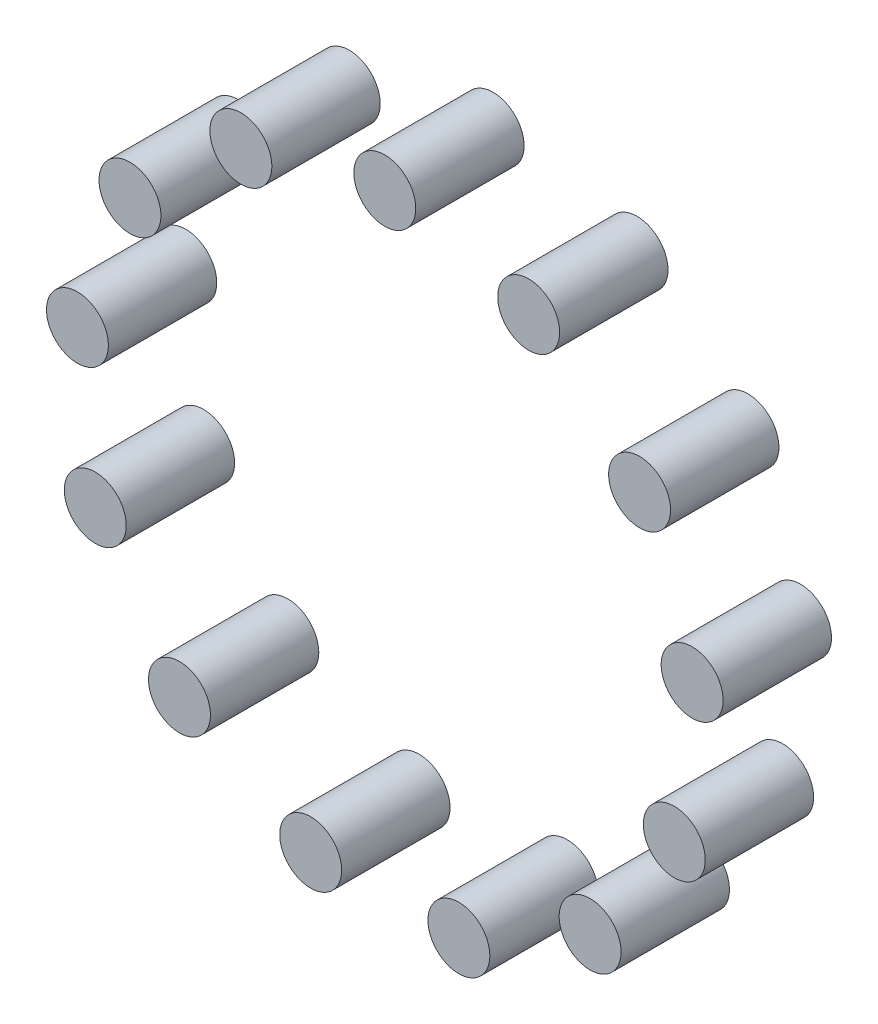
ISO-10303-21;
HEADER;
FILE_DESCRIPTION(('STEP AP214'),'2;1');
FILE_NAME('part.step','',(''),(''),'','','');
FILE_SCHEMA(('AUTOMOTIVE_DESIGN { 1 0 10303 214 1 1 1 1 }'));
ENDSEC;
DATA;
#1=APPLICATION_CONTEXT('core data for automotive mechanical design processes');
#2=APPLICATION_PROTOCOL_DEFINITION('international standard','automotive_design',2000,#1);
#3=PRODUCT_CONTEXT('',#1,'mechanical');
#4=PRODUCT('Part','Part','',(#3));
#5=PRODUCT_RELATED_PRODUCT_CATEGORY('part','',(#4));
#6=PRODUCT_DEFINITION_FORMATION('','',#4);
#7=PRODUCT_DEFINITION_CONTEXT('part definition',#1,'design');
#8=PRODUCT_DEFINITION('design','',#6,#7);
#9=PRODUCT_DEFINITION_SHAPE('','',#8);
#10=(LENGTH_UNIT() NAMED_UNIT(*) SI_UNIT(.MILLI.,.METRE.));
#11=(NAMED_UNIT(*) PLANE_ANGLE_UNIT() SI_UNIT($,.RADIAN.));
#12=(NAMED_UNIT(*) SI_UNIT($,.STERADIAN.) SOLID_ANGLE_UNIT());
#13=UNCERTAINTY_MEASURE_WITH_UNIT(LENGTH_MEASURE(1.E-05),#10,'distance_accuracy_value','');
#14=(GEOMETRIC_REPRESENTATION_CONTEXT(3) GLOBAL_UNCERTAINTY_ASSIGNED_CONTEXT((#13)) GLOBAL_UNIT_ASSIGNED_CONTEXT((#10,
#11,#12)) REPRESENTATION_CONTEXT('',''));
#15=CARTESIAN_POINT('',(0.,0.,0.));
#16=DIRECTION('',(0.,0.,1.));
#17=DIRECTION('',(1.,0.,0.));
#18=AXIS2_PLACEMENT_3D('',#15,#16,#17);
#19=CARTESIAN_POINT('',(-18.5889268817507,35.4182410261284,14.));
#20=DIRECTION('',(0.,0.,-1.));
#21=DIRECTION('',(-1.,0.,0.));
#22=AXIS2_PLACEMENT_3D('',#19,#20,#21);
#23=CYLINDRICAL_SURFACE('',#22,3.99999999999999);
#24=CARTESIAN_POINT('',(-18.5889268817507,35.4182410261284,14.));
#25=DIRECTION('',(0.,0.,1.));
#26=DIRECTION('',(1.,0.,0.));
#27=AXIS2_PLACEMENT_3D('',#24,#25,#26);
#28=CIRCLE('',#27,3.99999999999999);
#29=CARTESIAN_POINT('',(-14.5889268817507,35.4182410261284,14.));
#30=VERTEX_POINT('',#29);
#31=EDGE_CURVE('E11',#30,#30,#28,.T.);
#32=ORIENTED_EDGE('',*,*,#31,.F.);
#33=EDGE_LOOP('',(#32));
#34=FACE_BOUND('',#33,.T.);
#35=CARTESIAN_POINT('',(-18.5889268817507,35.4182410261284,0.));
#36=DIRECTION('',(0.,0.,1.));
#37=DIRECTION('',(1.,0.,0.));
#38=AXIS2_PLACEMENT_3D('',#35,#36,#37);
#39=CIRCLE('',#38,3.99999999999999);
#40=CARTESIAN_POINT('',(-14.5889268817507,35.4182410261284,0.));
#41=VERTEX_POINT('',#40);
#42=EDGE_CURVE('E55',#41,#41,#39,.T.);
#43=ORIENTED_EDGE('',*,*,#42,.T.);
#44=EDGE_LOOP('',(#43));
#45=FACE_BOUND('',#44,.T.);
#46=ADVANCED_FACE('F52',(#34,#45),#23,.T.);
#47=CARTESIAN_POINT('',(-18.5889268817507,35.4182410261284,14.));
#48=DIRECTION('',(0.,0.,1.));
#49=DIRECTION('',(1.,0.,0.));
#50=AXIS2_PLACEMENT_3D('',#47,#48,#49);
#51=PLANE('',#50);
#52=ORIENTED_EDGE('',*,*,#31,.T.);
#53=EDGE_LOOP('',(#52));
#54=FACE_BOUND('',#53,.T.);
#55=ADVANCED_FACE('F67',(#54),#51,.T.);
#56=CARTESIAN_POINT('',(-18.5889268817507,35.4182410261284,0.));
#57=DIRECTION('',(0.,0.,1.));
#58=DIRECTION('',(1.,0.,0.));
#59=AXIS2_PLACEMENT_3D('',#56,#57,#58);
#60=PLANE('',#59);
#61=ORIENTED_EDGE('',*,*,#42,.F.);
#62=EDGE_LOOP('',(#61));
#63=FACE_BOUND('',#62,.T.);
#64=ADVANCED_FACE('F65',(#63),#60,.F.);
#65=CLOSED_SHELL('',(#46,#55,#64));
#66=MANIFOLD_SOLID_BREP('B2',#65);
#67=CARTESIAN_POINT('',(-32.9193546357463,22.7225898692462,14.));
#68=DIRECTION('',(0.,0.,-1.));
#69=DIRECTION('',(-1.,0.,0.));
#70=AXIS2_PLACEMENT_3D('',#67,#68,#69);
#71=CYLINDRICAL_SURFACE('',#70,4.00000000000001);
#72=CARTESIAN_POINT('',(-32.9193546357463,22.7225898692462,14.));
#73=DIRECTION('',(0.,0.,1.));
#74=DIRECTION('',(1.,0.,0.));
#75=AXIS2_PLACEMENT_3D('',#72,#73,#74);
#76=CIRCLE('',#75,4.00000000000001);
#77=CARTESIAN_POINT('',(-28.9193546357463,22.7225898692462,14.));
#78=VERTEX_POINT('',#77);
#79=EDGE_CURVE('E51',#78,#78,#76,.T.);
#80=ORIENTED_EDGE('',*,*,#79,.F.);
#81=EDGE_LOOP('',(#80));
#82=FACE_BOUND('',#81,.T.);
#83=CARTESIAN_POINT('',(-32.9193546357463,22.7225898692462,0.));
#84=DIRECTION('',(0.,0.,1.));
#85=DIRECTION('',(1.,0.,0.));
#86=AXIS2_PLACEMENT_3D('',#83,#84,#85);
#87=CIRCLE('',#86,4.00000000000001);
#88=CARTESIAN_POINT('',(-28.9193546357463,22.7225898692462,0.));
#89=VERTEX_POINT('',#88);
#90=EDGE_CURVE('E106',#89,#89,#87,.T.);
#91=ORIENTED_EDGE('',*,*,#90,.T.);
#92=EDGE_LOOP('',(#91));
#93=FACE_BOUND('',#92,.T.);
#94=ADVANCED_FACE('F103',(#82,#93),#71,.T.);
#95=CARTESIAN_POINT('',(-32.9193546357463,22.7225898692462,14.));
#96=DIRECTION('',(0.,0.,1.));
#97=DIRECTION('',(1.,0.,0.));
#98=AXIS2_PLACEMENT_3D('',#95,#96,#97);
#99=PLANE('',#98);
#100=ORIENTED_EDGE('',*,*,#79,.T.);
#101=EDGE_LOOP('',(#100));
#102=FACE_BOUND('',#101,.T.);
#103=ADVANCED_FACE('F118',(#102),#99,.T.);
#104=CARTESIAN_POINT('',(-32.9193546357463,22.7225898692462,0.));
#105=DIRECTION('',(0.,0.,1.));
#106=DIRECTION('',(1.,0.,0.));
#107=AXIS2_PLACEMENT_3D('',#104,#105,#106);
#108=PLANE('',#107);
#109=ORIENTED_EDGE('',*,*,#90,.F.);
#110=EDGE_LOOP('',(#109));
#111=FACE_BOUND('',#110,.T.);
#112=ADVANCED_FACE('F116',(#111),#108,.F.);
#113=CLOSED_SHELL('',(#94,#103,#112));
#114=MANIFOLD_SOLID_BREP('B6',#113);
#115=CARTESIAN_POINT('',(-39.7083549639222,4.82146721021289,14.));
#116=DIRECTION('',(0.,0.,-1.));
#117=DIRECTION('',(-1.,0.,0.));
#118=AXIS2_PLACEMENT_3D('',#115,#116,#117);
#119=CYLINDRICAL_SURFACE('',#118,4.00000000000001);
#120=CARTESIAN_POINT('',(-39.7083549639222,4.82146721021289,14.));
#121=DIRECTION('',(0.,0.,1.));
#122=DIRECTION('',(1.,0.,0.));
#123=AXIS2_PLACEMENT_3D('',#120,#121,#122);
#124=CIRCLE('',#123,4.00000000000001);
#125=CARTESIAN_POINT('',(-35.7083549639222,4.82146721021289,14.));
#126=VERTEX_POINT('',#125);
#127=EDGE_CURVE('E102',#126,#126,#124,.T.);
#128=ORIENTED_EDGE('',*,*,#127,.F.);
#129=EDGE_LOOP('',(#128));
#130=FACE_BOUND('',#129,.T.);
#131=CARTESIAN_POINT('',(-39.7083549639222,4.82146721021289,0.));
#132=DIRECTION('',(0.,0.,1.));
#133=DIRECTION('',(1.,0.,0.));
#134=AXIS2_PLACEMENT_3D('',#131,#132,#133);
#135=CIRCLE('',#134,4.00000000000001);
#136=CARTESIAN_POINT('',(-35.7083549639222,4.82146721021289,0.));
#137=VERTEX_POINT('',#136);
#138=EDGE_CURVE('E157',#137,#137,#135,.T.);
#139=ORIENTED_EDGE('',*,*,#138,.T.);
#140=EDGE_LOOP('',(#139));
#141=FACE_BOUND('',#140,.T.);
#142=ADVANCED_FACE('F154',(#130,#141),#119,.T.);
#143=CARTESIAN_POINT('',(-39.7083549639222,4.82146721021289,14.));
#144=DIRECTION('',(0.,0.,1.));
#145=DIRECTION('',(1.,0.,0.));
#146=AXIS2_PLACEMENT_3D('',#143,#144,#145);
#147=PLANE('',#146);
#148=ORIENTED_EDGE('',*,*,#127,.T.);
#149=EDGE_LOOP('',(#148));
#150=FACE_BOUND('',#149,.T.);
#151=ADVANCED_FACE('F169',(#150),#147,.T.);
#152=CARTESIAN_POINT('',(-39.7083549639222,4.82146721021289,0.));
#153=DIRECTION('',(0.,0.,1.));
#154=DIRECTION('',(1.,0.,0.));
#155=AXIS2_PLACEMENT_3D('',#152,#153,#154);
#156=PLANE('',#155);
#157=ORIENTED_EDGE('',*,*,#138,.F.);
#158=EDGE_LOOP('',(#157));
#159=FACE_BOUND('',#158,.T.);
#160=ADVANCED_FACE('F167',(#159),#156,.F.);
#161=CLOSED_SHELL('',(#142,#151,#160));
#162=MANIFOLD_SOLID_BREP('B46',#161);
#163=CARTESIAN_POINT('',(-37.4006497074166,-14.1841954817014,14.));
#164=DIRECTION('',(0.,0.,-1.));
#165=DIRECTION('',(-1.,0.,0.));
#166=AXIS2_PLACEMENT_3D('',#163,#164,#165);
#167=CYLINDRICAL_SURFACE('',#166,4.);
#168=CARTESIAN_POINT('',(-37.4006497074166,-14.1841954817014,14.));
#169=DIRECTION('',(0.,0.,1.));
#170=DIRECTION('',(1.,0.,0.));
#171=AXIS2_PLACEMENT_3D('',#168,#169,#170);
#172=CIRCLE('',#171,4.);
#173=CARTESIAN_POINT('',(-33.4006497074166,-14.1841954817014,14.));
#174=VERTEX_POINT('',#173);
#175=EDGE_CURVE('E153',#174,#174,#172,.T.);
#176=ORIENTED_EDGE('',*,*,#175,.F.);
#177=EDGE_LOOP('',(#176));
#178=FACE_BOUND('',#177,.T.);
#179=CARTESIAN_POINT('',(-37.4006497074166,-14.1841954817014,0.));
#180=DIRECTION('',(0.,0.,1.));
#181=DIRECTION('',(1.,0.,0.));
#182=AXIS2_PLACEMENT_3D('',#179,#180,#181);
#183=CIRCLE('',#182,4.);
#184=CARTESIAN_POINT('',(-33.4006497074166,-14.1841954817014,0.));
#185=VERTEX_POINT('',#184);
#186=EDGE_CURVE('E208',#185,#185,#183,.T.);
#187=ORIENTED_EDGE('',*,*,#186,.T.);
#188=EDGE_LOOP('',(#187));
#189=FACE_BOUND('',#188,.T.);
#190=ADVANCED_FACE('F205',(#178,#189),#167,.T.);
#191=CARTESIAN_POINT('',(-37.4006497074166,-14.1841954817014,14.));
#192=DIRECTION('',(0.,0.,1.));
#193=DIRECTION('',(1.,0.,0.));
#194=AXIS2_PLACEMENT_3D('',#191,#192,#193);
#195=PLANE('',#194);
#196=ORIENTED_EDGE('',*,*,#175,.T.);
#197=EDGE_LOOP('',(#196));
#198=FACE_BOUND('',#197,.T.);
#199=ADVANCED_FACE('F220',(#198),#195,.T.);
#200=CARTESIAN_POINT('',(-37.4006497074166,-14.1841954817014,0.));
#201=DIRECTION('',(0.,0.,1.));
#202=DIRECTION('',(1.,0.,0.));
#203=AXIS2_PLACEMENT_3D('',#200,#201,#202);
#204=PLANE('',#203);
#205=ORIENTED_EDGE('',*,*,#186,.F.);
#206=EDGE_LOOP('',(#205));
#207=FACE_BOUND('',#206,.T.);
#208=ADVANCED_FACE('F218',(#207),#204,.F.);
#209=CLOSED_SHELL('',(#190,#199,#208));
#210=MANIFOLD_SOLID_BREP('B97',#209);
#211=CARTESIAN_POINT('',(-26.5249063296318,-29.9404299268441,14.));
#212=DIRECTION('',(0.,0.,-1.));
#213=DIRECTION('',(-1.,0.,0.));
#214=AXIS2_PLACEMENT_3D('',#211,#212,#213);
#215=CYLINDRICAL_SURFACE('',#214,4.);
#216=CARTESIAN_POINT('',(-26.5249063296318,-29.9404299268441,14.));
#217=DIRECTION('',(0.,0.,1.));
#218=DIRECTION('',(1.,0.,0.));
#219=AXIS2_PLACEMENT_3D('',#216,#217,#218);
#220=CIRCLE('',#219,4.);
#221=CARTESIAN_POINT('',(-22.5249063296318,-29.9404299268441,14.));
#222=VERTEX_POINT('',#221);
#223=EDGE_CURVE('E204',#222,#222,#220,.T.);
#224=ORIENTED_EDGE('',*,*,#223,.F.);
#225=EDGE_LOOP('',(#224));
#226=FACE_BOUND('',#225,.T.);
#227=CARTESIAN_POINT('',(-26.5249063296318,-29.9404299268441,0.));
#228=DIRECTION('',(0.,0.,1.));
#229=DIRECTION('',(1.,0.,0.));
#230=AXIS2_PLACEMENT_3D('',#227,#228,#229);
#231=CIRCLE('',#230,4.);
#232=CARTESIAN_POINT('',(-22.5249063296318,-29.9404299268441,0.));
#233=VERTEX_POINT('',#232);
#234=EDGE_CURVE('E259',#233,#233,#231,.T.);
#235=ORIENTED_EDGE('',*,*,#234,.T.);
#236=EDGE_LOOP('',(#235));
#237=FACE_BOUND('',#236,.T.);
#238=ADVANCED_FACE('F256',(#226,#237),#215,.T.);
#239=CARTESIAN_POINT('',(-26.5249063296318,-29.9404299268441,14.));
#240=DIRECTION('',(0.,0.,1.));
#241=DIRECTION('',(1.,0.,0.));
#242=AXIS2_PLACEMENT_3D('',#239,#240,#241);
#243=PLANE('',#242);
#244=ORIENTED_EDGE('',*,*,#223,.T.);
#245=EDGE_LOOP('',(#244));
#246=FACE_BOUND('',#245,.T.);
#247=ADVANCED_FACE('F271',(#246),#243,.T.);
#248=CARTESIAN_POINT('',(-26.5249063296318,-29.9404299268441,0.));
#249=DIRECTION('',(0.,0.,1.));
#250=DIRECTION('',(1.,0.,0.));
#251=AXIS2_PLACEMENT_3D('',#248,#249,#250);
#252=PLANE('',#251);
#253=ORIENTED_EDGE('',*,*,#234,.F.);
#254=EDGE_LOOP('',(#253));
#255=FACE_BOUND('',#254,.T.);
#256=ADVANCED_FACE('F269',(#255),#252,.F.);
#257=CLOSED_SHELL('',(#238,#247,#256));
#258=MANIFOLD_SOLID_BREP('B148',#257);
#259=CARTESIAN_POINT('',(-9.5726265715023,-38.8376726970421,14.));
#260=DIRECTION('',(0.,0.,-1.));
#261=DIRECTION('',(-1.,0.,0.));
#262=AXIS2_PLACEMENT_3D('',#259,#260,#261);
#263=CYLINDRICAL_SURFACE('',#262,4.);
#264=CARTESIAN_POINT('',(-9.5726265715023,-38.8376726970421,14.));
#265=DIRECTION('',(0.,0.,1.));
#266=DIRECTION('',(1.,0.,0.));
#267=AXIS2_PLACEMENT_3D('',#264,#265,#266);
#268=CIRCLE('',#267,4.);
#269=CARTESIAN_POINT('',(-5.57262657150229,-38.8376726970421,14.));
#270=VERTEX_POINT('',#269);
#271=EDGE_CURVE('E255',#270,#270,#268,.T.);
#272=ORIENTED_EDGE('',*,*,#271,.F.);
#273=EDGE_LOOP('',(#272));
#274=FACE_BOUND('',#273,.T.);
#275=CARTESIAN_POINT('',(-9.5726265715023,-38.8376726970421,0.));
#276=DIRECTION('',(0.,0.,1.));
#277=DIRECTION('',(1.,0.,0.));
#278=AXIS2_PLACEMENT_3D('',#275,#276,#277);
#279=CIRCLE('',#278,4.);
#280=CARTESIAN_POINT('',(-5.57262657150229,-38.8376726970421,0.));
#281=VERTEX_POINT('',#280);
#282=EDGE_CURVE('E310',#281,#281,#279,.T.);
#283=ORIENTED_EDGE('',*,*,#282,.T.);
#284=EDGE_LOOP('',(#283));
#285=FACE_BOUND('',#284,.T.);
#286=ADVANCED_FACE('F307',(#274,#285),#263,.T.);
#287=CARTESIAN_POINT('',(-9.5726265715023,-38.8376726970421,14.));
#288=DIRECTION('',(0.,0.,1.));
#289=DIRECTION('',(1.,0.,0.));
#290=AXIS2_PLACEMENT_3D('',#287,#288,#289);
#291=PLANE('',#290);
#292=ORIENTED_EDGE('',*,*,#271,.T.);
#293=EDGE_LOOP('',(#292));
#294=FACE_BOUND('',#293,.T.);
#295=ADVANCED_FACE('F322',(#294),#291,.T.);
#296=CARTESIAN_POINT('',(-9.5726265715023,-38.8376726970421,0.));
#297=DIRECTION('',(0.,0.,1.));
#298=DIRECTION('',(1.,0.,0.));
#299=AXIS2_PLACEMENT_3D('',#296,#297,#298);
#300=PLANE('',#299);
#301=ORIENTED_EDGE('',*,*,#282,.F.);
#302=EDGE_LOOP('',(#301));
#303=FACE_BOUND('',#302,.T.);
#304=ADVANCED_FACE('F320',(#303),#300,.F.);
#305=CLOSED_SHELL('',(#286,#295,#304));
#306=MANIFOLD_SOLID_BREP('B199',#305);
#307=CARTESIAN_POINT('',(9.57262657150233,-38.8376726970421,14.));
#308=DIRECTION('',(0.,0.,-1.));
#309=DIRECTION('',(-1.,0.,0.));
#310=AXIS2_PLACEMENT_3D('',#307,#308,#309);
#311=CYLINDRICAL_SURFACE('',#310,4.00000000000001);
#312=CARTESIAN_POINT('',(9.57262657150233,-38.8376726970421,14.));
#313=DIRECTION('',(0.,0.,1.));
#314=DIRECTION('',(1.,0.,0.));
#315=AXIS2_PLACEMENT_3D('',#312,#313,#314);
#316=CIRCLE('',#315,4.00000000000001);
#317=CARTESIAN_POINT('',(13.5726265715023,-38.8376726970421,14.));
#318=VERTEX_POINT('',#317);
#319=EDGE_CURVE('E306',#318,#318,#316,.T.);
#320=ORIENTED_EDGE('',*,*,#319,.F.);
#321=EDGE_LOOP('',(#320));
#322=FACE_BOUND('',#321,.T.);
#323=CARTESIAN_POINT('',(9.57262657150233,-38.8376726970421,0.));
#324=DIRECTION('',(0.,0.,1.));
#325=DIRECTION('',(1.,0.,0.));
#326=AXIS2_PLACEMENT_3D('',#323,#324,#325);
#327=CIRCLE('',#326,4.00000000000001);
#328=CARTESIAN_POINT('',(13.5726265715023,-38.8376726970421,0.));
#329=VERTEX_POINT('',#328);
#330=EDGE_CURVE('E361',#329,#329,#327,.T.);
#331=ORIENTED_EDGE('',*,*,#330,.T.);
#332=EDGE_LOOP('',(#331));
#333=FACE_BOUND('',#332,.T.);
#334=ADVANCED_FACE('F358',(#322,#333),#311,.T.);
#335=CARTESIAN_POINT('',(9.57262657150233,-38.8376726970421,14.));
#336=DIRECTION('',(0.,0.,1.));
#337=DIRECTION('',(1.,0.,0.));
#338=AXIS2_PLACEMENT_3D('',#335,#336,#337);
#339=PLANE('',#338);
#340=ORIENTED_EDGE('',*,*,#319,.T.);
#341=EDGE_LOOP('',(#340));
#342=FACE_BOUND('',#341,.T.);
#343=ADVANCED_FACE('F373',(#342),#339,.T.);
#344=CARTESIAN_POINT('',(9.57262657150233,-38.8376726970421,0.));
#345=DIRECTION('',(0.,0.,1.));
#346=DIRECTION('',(1.,0.,0.));
#347=AXIS2_PLACEMENT_3D('',#344,#345,#346);
#348=PLANE('',#347);
#349=ORIENTED_EDGE('',*,*,#330,.F.);
#350=EDGE_LOOP('',(#349));
#351=FACE_BOUND('',#350,.T.);
#352=ADVANCED_FACE('F371',(#351),#348,.F.);
#353=CLOSED_SHELL('',(#334,#343,#352));
#354=MANIFOLD_SOLID_BREP('B250',#353);
#355=CARTESIAN_POINT('',(26.5249063296318,-29.940429926844,14.));
#356=DIRECTION('',(0.,0.,-1.));
#357=DIRECTION('',(-1.,0.,0.));
#358=AXIS2_PLACEMENT_3D('',#355,#356,#357);
#359=CYLINDRICAL_SURFACE('',#358,4.00000000000001);
#360=CARTESIAN_POINT('',(26.5249063296318,-29.940429926844,14.));
#361=DIRECTION('',(0.,0.,1.));
#362=DIRECTION('',(1.,0.,0.));
#363=AXIS2_PLACEMENT_3D('',#360,#361,#362);
#364=CIRCLE('',#363,4.00000000000001);
#365=CARTESIAN_POINT('',(30.5249063296318,-29.940429926844,14.));
#366=VERTEX_POINT('',#365);
#367=EDGE_CURVE('E357',#366,#366,#364,.T.);
#368=ORIENTED_EDGE('',*,*,#367,.F.);
#369=EDGE_LOOP('',(#368));
#370=FACE_BOUND('',#369,.T.);
#371=CARTESIAN_POINT('',(26.5249063296318,-29.940429926844,0.));
#372=DIRECTION('',(0.,0.,1.));
#373=DIRECTION('',(1.,0.,0.));
#374=AXIS2_PLACEMENT_3D('',#371,#372,#373);
#375=CIRCLE('',#374,4.00000000000001);
#376=CARTESIAN_POINT('',(30.5249063296318,-29.940429926844,0.));
#377=VERTEX_POINT('',#376);
#378=EDGE_CURVE('E412',#377,#377,#375,.T.);
#379=ORIENTED_EDGE('',*,*,#378,.T.);
#380=EDGE_LOOP('',(#379));
#381=FACE_BOUND('',#380,.T.);
#382=ADVANCED_FACE('F409',(#370,#381),#359,.T.);
#383=CARTESIAN_POINT('',(26.5249063296318,-29.940429926844,14.));
#384=DIRECTION('',(0.,0.,1.));
#385=DIRECTION('',(1.,0.,0.));
#386=AXIS2_PLACEMENT_3D('',#383,#384,#385);
#387=PLANE('',#386);
#388=ORIENTED_EDGE('',*,*,#367,.T.);
#389=EDGE_LOOP('',(#388));
#390=FACE_BOUND('',#389,.T.);
#391=ADVANCED_FACE('F424',(#390),#387,.T.);
#392=CARTESIAN_POINT('',(26.5249063296318,-29.940429926844,0.));
#393=DIRECTION('',(0.,0.,1.));
#394=DIRECTION('',(1.,0.,0.));
#395=AXIS2_PLACEMENT_3D('',#392,#393,#394);
#396=PLANE('',#395);
#397=ORIENTED_EDGE('',*,*,#378,.F.);
#398=EDGE_LOOP('',(#397));
#399=FACE_BOUND('',#398,.T.);
#400=ADVANCED_FACE('F422',(#399),#396,.F.);
#401=CLOSED_SHELL('',(#382,#391,#400));
#402=MANIFOLD_SOLID_BREP('B301',#401);
#403=CARTESIAN_POINT('',(37.4006497074166,-14.1841954817014,14.));
#404=DIRECTION('',(0.,0.,-1.));
#405=DIRECTION('',(-1.,0.,0.));
#406=AXIS2_PLACEMENT_3D('',#403,#404,#405);
#407=CYLINDRICAL_SURFACE('',#406,4.);
#408=CARTESIAN_POINT('',(37.4006497074166,-14.1841954817014,14.));
#409=DIRECTION('',(0.,0.,1.));
#410=DIRECTION('',(1.,0.,0.));
#411=AXIS2_PLACEMENT_3D('',#408,#409,#410);
#412=CIRCLE('',#411,4.);
#413=CARTESIAN_POINT('',(41.4006497074166,-14.1841954817014,14.));
#414=VERTEX_POINT('',#413);
#415=EDGE_CURVE('E408',#414,#414,#412,.T.);
#416=ORIENTED_EDGE('',*,*,#415,.F.);
#417=EDGE_LOOP('',(#416));
#418=FACE_BOUND('',#417,.T.);
#419=CARTESIAN_POINT('',(37.4006497074166,-14.1841954817014,0.));
#420=DIRECTION('',(0.,0.,1.));
#421=DIRECTION('',(1.,0.,0.));
#422=AXIS2_PLACEMENT_3D('',#419,#420,#421);
#423=CIRCLE('',#422,4.);
#424=CARTESIAN_POINT('',(41.4006497074166,-14.1841954817014,0.));
#425=VERTEX_POINT('',#424);
#426=EDGE_CURVE('E463',#425,#425,#423,.T.);
#427=ORIENTED_EDGE('',*,*,#426,.T.);
#428=EDGE_LOOP('',(#427));
#429=FACE_BOUND('',#428,.T.);
#430=ADVANCED_FACE('F460',(#418,#429),#407,.T.);
#431=CARTESIAN_POINT('',(37.4006497074166,-14.1841954817014,14.));
#432=DIRECTION('',(0.,0.,1.));
#433=DIRECTION('',(1.,0.,0.));
#434=AXIS2_PLACEMENT_3D('',#431,#432,#433);
#435=PLANE('',#434);
#436=ORIENTED_EDGE('',*,*,#415,.T.);
#437=EDGE_LOOP('',(#436));
#438=FACE_BOUND('',#437,.T.);
#439=ADVANCED_FACE('F475',(#438),#435,.T.);
#440=CARTESIAN_POINT('',(37.4006497074166,-14.1841954817014,0.));
#441=DIRECTION('',(0.,0.,1.));
#442=DIRECTION('',(1.,0.,0.));
#443=AXIS2_PLACEMENT_3D('',#440,#441,#442);
#444=PLANE('',#443);
#445=ORIENTED_EDGE('',*,*,#426,.F.);
#446=EDGE_LOOP('',(#445));
#447=FACE_BOUND('',#446,.T.);
#448=ADVANCED_FACE('F473',(#447),#444,.F.);
#449=CLOSED_SHELL('',(#430,#439,#448));
#450=MANIFOLD_SOLID_BREP('B352',#449);
#451=CARTESIAN_POINT('',(39.7083549639222,4.82146721021293,14.));
#452=DIRECTION('',(0.,0.,-1.));
#453=DIRECTION('',(-1.,0.,0.));
#454=AXIS2_PLACEMENT_3D('',#451,#452,#453);
#455=CYLINDRICAL_SURFACE('',#454,4.00000000000001);
#456=CARTESIAN_POINT('',(39.7083549639222,4.82146721021293,14.));
#457=DIRECTION('',(0.,0.,1.));
#458=DIRECTION('',(1.,0.,0.));
#459=AXIS2_PLACEMENT_3D('',#456,#457,#458);
#460=CIRCLE('',#459,4.00000000000001);
#461=CARTESIAN_POINT('',(43.7083549639222,4.82146721021293,14.));
#462=VERTEX_POINT('',#461);
#463=EDGE_CURVE('E459',#462,#462,#460,.T.);
#464=ORIENTED_EDGE('',*,*,#463,.F.);
#465=EDGE_LOOP('',(#464));
#466=FACE_BOUND('',#465,.T.);
#467=CARTESIAN_POINT('',(39.7083549639222,4.82146721021293,0.));
#468=DIRECTION('',(0.,0.,1.));
#469=DIRECTION('',(1.,0.,0.));
#470=AXIS2_PLACEMENT_3D('',#467,#468,#469);
#471=CIRCLE('',#470,4.00000000000001);
#472=CARTESIAN_POINT('',(43.7083549639222,4.82146721021293,0.));
#473=VERTEX_POINT('',#472);
#474=EDGE_CURVE('E514',#473,#473,#471,.T.);
#475=ORIENTED_EDGE('',*,*,#474,.T.);
#476=EDGE_LOOP('',(#475));
#477=FACE_BOUND('',#476,.T.);
#478=ADVANCED_FACE('F511',(#466,#477),#455,.T.);
#479=CARTESIAN_POINT('',(39.7083549639222,4.82146721021293,14.));
#480=DIRECTION('',(0.,0.,1.));
#481=DIRECTION('',(1.,0.,0.));
#482=AXIS2_PLACEMENT_3D('',#479,#480,#481);
#483=PLANE('',#482);
#484=ORIENTED_EDGE('',*,*,#463,.T.);
#485=EDGE_LOOP('',(#484));
#486=FACE_BOUND('',#485,.T.);
#487=ADVANCED_FACE('F526',(#486),#483,.T.);
#488=CARTESIAN_POINT('',(39.7083549639222,4.82146721021293,0.));
#489=DIRECTION('',(0.,0.,1.));
#490=DIRECTION('',(1.,0.,0.));
#491=AXIS2_PLACEMENT_3D('',#488,#489,#490);
#492=PLANE('',#491);
#493=ORIENTED_EDGE('',*,*,#474,.F.);
#494=EDGE_LOOP('',(#493));
#495=FACE_BOUND('',#494,.T.);
#496=ADVANCED_FACE('F524',(#495),#492,.F.);
#497=CLOSED_SHELL('',(#478,#487,#496));
#498=MANIFOLD_SOLID_BREP('B403',#497);
#499=CARTESIAN_POINT('',(32.9193546357463,22.7225898692462,14.));
#500=DIRECTION('',(0.,0.,-1.));
#501=DIRECTION('',(-1.,0.,0.));
#502=AXIS2_PLACEMENT_3D('',#499,#500,#501);
#503=CYLINDRICAL_SURFACE('',#502,4.00000000000001);
#504=CARTESIAN_POINT('',(32.9193546357463,22.7225898692462,14.));
#505=DIRECTION('',(0.,0.,1.));
#506=DIRECTION('',(1.,0.,0.));
#507=AXIS2_PLACEMENT_3D('',#504,#505,#506);
#508=CIRCLE('',#507,4.00000000000001);
#509=CARTESIAN_POINT('',(36.9193546357463,22.7225898692462,14.));
#510=VERTEX_POINT('',#509);
#511=EDGE_CURVE('E510',#510,#510,#508,.T.);
#512=ORIENTED_EDGE('',*,*,#511,.F.);
#513=EDGE_LOOP('',(#512));
#514=FACE_BOUND('',#513,.T.);
#515=CARTESIAN_POINT('',(32.9193546357463,22.7225898692462,0.));
#516=DIRECTION('',(0.,0.,1.));
#517=DIRECTION('',(1.,0.,0.));
#518=AXIS2_PLACEMENT_3D('',#515,#516,#517);
#519=CIRCLE('',#518,4.00000000000001);
#520=CARTESIAN_POINT('',(36.9193546357463,22.7225898692462,0.));
#521=VERTEX_POINT('',#520);
#522=EDGE_CURVE('E565',#521,#521,#519,.T.);
#523=ORIENTED_EDGE('',*,*,#522,.T.);
#524=EDGE_LOOP('',(#523));
#525=FACE_BOUND('',#524,.T.);
#526=ADVANCED_FACE('F562',(#514,#525),#503,.T.);
#527=CARTESIAN_POINT('',(32.9193546357463,22.7225898692462,14.));
#528=DIRECTION('',(0.,0.,1.));
#529=DIRECTION('',(1.,0.,0.));
#530=AXIS2_PLACEMENT_3D('',#527,#528,#529);
#531=PLANE('',#530);
#532=ORIENTED_EDGE('',*,*,#511,.T.);
#533=EDGE_LOOP('',(#532));
#534=FACE_BOUND('',#533,.T.);
#535=ADVANCED_FACE('F577',(#534),#531,.T.);
#536=CARTESIAN_POINT('',(32.9193546357463,22.7225898692462,0.));
#537=DIRECTION('',(0.,0.,1.));
#538=DIRECTION('',(1.,0.,0.));
#539=AXIS2_PLACEMENT_3D('',#536,#537,#538);
#540=PLANE('',#539);
#541=ORIENTED_EDGE('',*,*,#522,.F.);
#542=EDGE_LOOP('',(#541));
#543=FACE_BOUND('',#542,.T.);
#544=ADVANCED_FACE('F575',(#543),#540,.F.);
#545=CLOSED_SHELL('',(#526,#535,#544));
#546=MANIFOLD_SOLID_BREP('B454',#545);
#547=CARTESIAN_POINT('',(18.5889268817507,35.4182410261284,14.));
#548=DIRECTION('',(0.,0.,-1.));
#549=DIRECTION('',(-1.,0.,0.));
#550=AXIS2_PLACEMENT_3D('',#547,#548,#549);
#551=CYLINDRICAL_SURFACE('',#550,4.00000000000001);
#552=CARTESIAN_POINT('',(18.5889268817507,35.4182410261284,14.));
#553=DIRECTION('',(0.,0.,1.));
#554=DIRECTION('',(1.,0.,0.));
#555=AXIS2_PLACEMENT_3D('',#552,#553,#554);
#556=CIRCLE('',#555,4.00000000000001);
#557=CARTESIAN_POINT('',(22.5889268817508,35.4182410261284,14.));
#558=VERTEX_POINT('',#557);
#559=EDGE_CURVE('E561',#558,#558,#556,.T.);
#560=ORIENTED_EDGE('',*,*,#559,.F.);
#561=EDGE_LOOP('',(#560));
#562=FACE_BOUND('',#561,.T.);
#563=CARTESIAN_POINT('',(18.5889268817507,35.4182410261284,0.));
#564=DIRECTION('',(0.,0.,1.));
#565=DIRECTION('',(1.,0.,0.));
#566=AXIS2_PLACEMENT_3D('',#563,#564,#565);
#567=CIRCLE('',#566,4.00000000000001);
#568=CARTESIAN_POINT('',(22.5889268817508,35.4182410261284,0.));
#569=VERTEX_POINT('',#568);
#570=EDGE_CURVE('E615',#569,#569,#567,.T.);
#571=ORIENTED_EDGE('',*,*,#570,.T.);
#572=EDGE_LOOP('',(#571));
#573=FACE_BOUND('',#572,.T.);
#574=ADVANCED_FACE('F612',(#562,#573),#551,.T.);
#575=CARTESIAN_POINT('',(18.5889268817507,35.4182410261284,14.));
#576=DIRECTION('',(0.,0.,1.));
#577=DIRECTION('',(1.,0.,0.));
#578=AXIS2_PLACEMENT_3D('',#575,#576,#577);
#579=PLANE('',#578);
#580=ORIENTED_EDGE('',*,*,#559,.T.);
#581=EDGE_LOOP('',(#580));
#582=FACE_BOUND('',#581,.T.);
#583=ADVANCED_FACE('F627',(#582),#579,.T.);
#584=CARTESIAN_POINT('',(18.5889268817507,35.4182410261284,0.));
#585=DIRECTION('',(0.,0.,1.));
#586=DIRECTION('',(1.,0.,0.));
#587=AXIS2_PLACEMENT_3D('',#584,#585,#586);
#588=PLANE('',#587);
#589=ORIENTED_EDGE('',*,*,#570,.F.);
#590=EDGE_LOOP('',(#589));
#591=FACE_BOUND('',#590,.T.);
#592=ADVANCED_FACE('F625',(#591),#588,.F.);
#593=CLOSED_SHELL('',(#574,#583,#592));
#594=MANIFOLD_SOLID_BREP('B505',#593);
#595=CARTESIAN_POINT('',(0.,40.,14.));
#596=DIRECTION('',(0.,0.,-1.));
#597=DIRECTION('',(-1.,0.,0.));
#598=AXIS2_PLACEMENT_3D('',#595,#596,#597);
#599=CYLINDRICAL_SURFACE('',#598,4.);
#600=CARTESIAN_POINT('',(0.,40.,14.));
#601=DIRECTION('',(0.,0.,1.));
#602=DIRECTION('',(1.,0.,0.));
#603=AXIS2_PLACEMENT_3D('',#600,#601,#602);
#604=CIRCLE('',#603,4.);
#605=CARTESIAN_POINT('',(4.,40.,14.));
#606=VERTEX_POINT('',#605);
#607=EDGE_CURVE('E611',#606,#606,#604,.T.);
#608=ORIENTED_EDGE('',*,*,#607,.F.);
#609=EDGE_LOOP('',(#608));
#610=FACE_BOUND('',#609,.T.);
#611=CARTESIAN_POINT('',(0.,40.,0.));
#612=DIRECTION('',(0.,0.,1.));
#613=DIRECTION('',(1.,0.,0.));
#614=AXIS2_PLACEMENT_3D('',#611,#612,#613);
#615=CIRCLE('',#614,4.);
#616=CARTESIAN_POINT('',(4.,40.,0.));
#617=VERTEX_POINT('',#616);
#618=EDGE_CURVE('E658',#617,#617,#615,.T.);
#619=ORIENTED_EDGE('',*,*,#618,.T.);
#620=EDGE_LOOP('',(#619));
#621=FACE_BOUND('',#620,.T.);
#622=ADVANCED_FACE('F655',(#610,#621),#599,.T.);
#623=CARTESIAN_POINT('',(0.,40.,14.));
#624=DIRECTION('',(0.,0.,1.));
#625=DIRECTION('',(1.,0.,0.));
#626=AXIS2_PLACEMENT_3D('',#623,#624,#625);
#627=PLANE('',#626);
#628=ORIENTED_EDGE('',*,*,#607,.T.);
#629=EDGE_LOOP('',(#628));
#630=FACE_BOUND('',#629,.T.);
#631=ADVANCED_FACE('F670',(#630),#627,.T.);
#632=CARTESIAN_POINT('',(0.,40.,0.));
#633=DIRECTION('',(0.,0.,1.));
#634=DIRECTION('',(1.,0.,0.));
#635=AXIS2_PLACEMENT_3D('',#632,#633,#634);
#636=PLANE('',#635);
#637=ORIENTED_EDGE('',*,*,#618,.F.);
#638=EDGE_LOOP('',(#637));
#639=FACE_BOUND('',#638,.T.);
#640=ADVANCED_FACE('F668',(#639),#636,.F.);
#641=CLOSED_SHELL('',(#622,#631,#640));
#642=MANIFOLD_SOLID_BREP('B556',#641);
#643=ADVANCED_BREP_SHAPE_REPRESENTATION('',(#18,#66,#114,#162,#210,#258,#306,#354,#402,#450,
#498,#546,#594,#642),#14);
#644=SHAPE_DEFINITION_REPRESENTATION(#9,#643);
ENDSEC;
END-ISO-10303-21;
